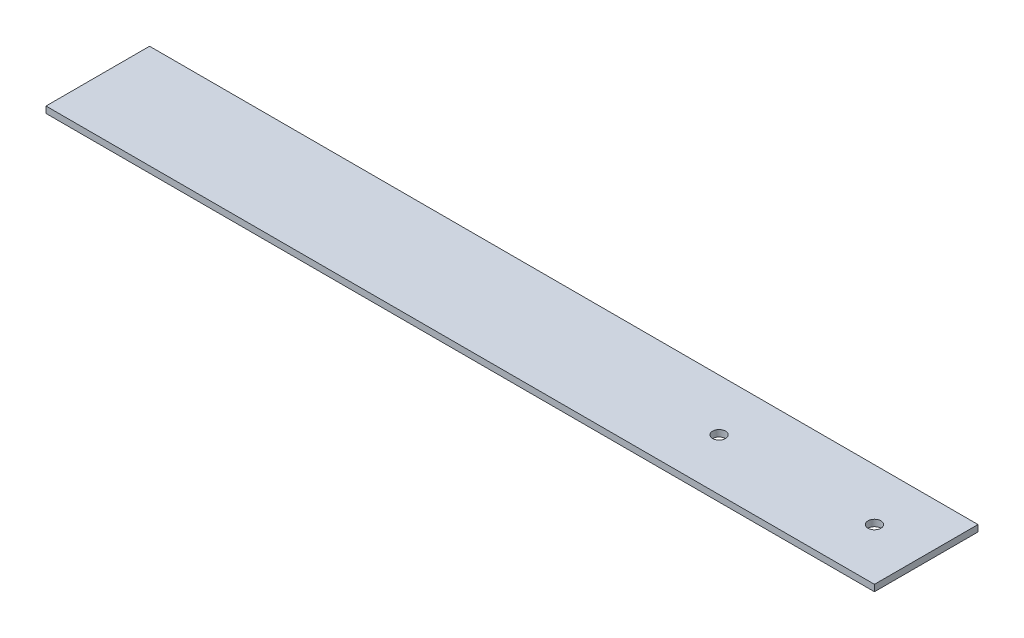
ISO-10303-21;
HEADER;
FILE_DESCRIPTION(('STEP AP214'),'2;1');
FILE_NAME('part.step','',(''),(''),'','','');
FILE_SCHEMA(('AUTOMOTIVE_DESIGN { 1 0 10303 214 1 1 1 1 }'));
ENDSEC;
DATA;
#1=APPLICATION_CONTEXT('core data for automotive mechanical design processes');
#2=APPLICATION_PROTOCOL_DEFINITION('international standard','automotive_design',2000,#1);
#3=PRODUCT_CONTEXT('',#1,'mechanical');
#4=PRODUCT('Part','Part','',(#3));
#5=PRODUCT_RELATED_PRODUCT_CATEGORY('part','',(#4));
#6=PRODUCT_DEFINITION_FORMATION('','',#4);
#7=PRODUCT_DEFINITION_CONTEXT('part definition',#1,'design');
#8=PRODUCT_DEFINITION('design','',#6,#7);
#9=PRODUCT_DEFINITION_SHAPE('','',#8);
#10=(LENGTH_UNIT() NAMED_UNIT(*) SI_UNIT(.MILLI.,.METRE.));
#11=(NAMED_UNIT(*) PLANE_ANGLE_UNIT() SI_UNIT($,.RADIAN.));
#12=(NAMED_UNIT(*) SI_UNIT($,.STERADIAN.) SOLID_ANGLE_UNIT());
#13=UNCERTAINTY_MEASURE_WITH_UNIT(LENGTH_MEASURE(1.E-05),#10,'distance_accuracy_value','');
#14=(GEOMETRIC_REPRESENTATION_CONTEXT(3) GLOBAL_UNCERTAINTY_ASSIGNED_CONTEXT((#13)) GLOBAL_UNIT_ASSIGNED_CONTEXT((#10,
#11,#12)) REPRESENTATION_CONTEXT('',''));
#15=CARTESIAN_POINT('',(0.,0.,0.));
#16=DIRECTION('',(0.,0.,1.));
#17=DIRECTION('',(1.,0.,0.));
#18=AXIS2_PLACEMENT_3D('',#15,#16,#17);
#19=CARTESIAN_POINT('',(0.,3.175,0.));
#20=DIRECTION('',(1.,0.,0.));
#21=DIRECTION('',(0.,0.,-1.));
#22=AXIS2_PLACEMENT_3D('',#19,#20,#21);
#23=PLANE('',#22);
#24=DIRECTION('',(0.,0.,1.));
#25=VECTOR('',#24,1.);
#26=CARTESIAN_POINT('',(0.,0.,0.));
#27=LINE('',#26,#25);
#28=CARTESIAN_POINT('',(0.,0.,-50.8));
#29=VERTEX_POINT('',#28);
#30=CARTESIAN_POINT('',(0.,0.,0.));
#31=VERTEX_POINT('',#30);
#32=EDGE_CURVE('E96',#29,#31,#27,.T.);
#33=ORIENTED_EDGE('',*,*,#32,.T.);
#34=DIRECTION('',(0.,-1.,0.));
#35=VECTOR('',#34,1.);
#36=CARTESIAN_POINT('',(0.,3.175,0.));
#37=LINE('',#36,#35);
#38=CARTESIAN_POINT('',(0.,3.175,0.));
#39=VERTEX_POINT('',#38);
#40=EDGE_CURVE('E11',#39,#31,#37,.T.);
#41=ORIENTED_EDGE('',*,*,#40,.F.);
#42=DIRECTION('',(0.,0.,1.));
#43=VECTOR('',#42,1.);
#44=CARTESIAN_POINT('',(0.,3.175,0.));
#45=LINE('',#44,#43);
#46=CARTESIAN_POINT('',(0.,3.175,-50.8));
#47=VERTEX_POINT('',#46);
#48=EDGE_CURVE('E84',#47,#39,#45,.T.);
#49=ORIENTED_EDGE('',*,*,#48,.F.);
#50=DIRECTION('',(0.,-1.,0.));
#51=VECTOR('',#50,1.);
#52=CARTESIAN_POINT('',(0.,3.175,-50.8));
#53=LINE('',#52,#51);
#54=EDGE_CURVE('E92',#47,#29,#53,.T.);
#55=ORIENTED_EDGE('',*,*,#54,.T.);
#56=EDGE_LOOP('',(#33,#41,#49,#55));
#57=FACE_BOUND('',#56,.T.);
#58=ADVANCED_FACE('F33',(#57),#23,.F.);
#59=CARTESIAN_POINT('',(0.,3.175,0.));
#60=DIRECTION('',(0.,0.,-1.));
#61=DIRECTION('',(-1.,0.,0.));
#62=AXIS2_PLACEMENT_3D('',#59,#60,#61);
#63=PLANE('',#62);
#64=DIRECTION('',(1.,0.,0.));
#65=VECTOR('',#64,1.);
#66=CARTESIAN_POINT('',(0.,0.,0.));
#67=LINE('',#66,#65);
#68=CARTESIAN_POINT('',(406.4,0.,0.));
#69=VERTEX_POINT('',#68);
#70=EDGE_CURVE('E88',#31,#69,#67,.T.);
#71=ORIENTED_EDGE('',*,*,#70,.T.);
#72=DIRECTION('',(0.,-1.,0.));
#73=VECTOR('',#72,1.);
#74=CARTESIAN_POINT('',(406.4,3.175,0.));
#75=LINE('',#74,#73);
#76=CARTESIAN_POINT('',(406.4,3.175,0.));
#77=VERTEX_POINT('',#76);
#78=EDGE_CURVE('E41',#77,#69,#75,.T.);
#79=ORIENTED_EDGE('',*,*,#78,.F.);
#80=DIRECTION('',(1.,0.,0.));
#81=VECTOR('',#80,1.);
#82=CARTESIAN_POINT('',(0.,3.175,0.));
#83=LINE('',#82,#81);
#84=EDGE_CURVE('E79',#39,#77,#83,.T.);
#85=ORIENTED_EDGE('',*,*,#84,.F.);
#86=ORIENTED_EDGE('',*,*,#40,.T.);
#87=EDGE_LOOP('',(#71,#79,#85,#86));
#88=FACE_BOUND('',#87,.T.);
#89=ADVANCED_FACE('F87',(#88),#63,.F.);
#90=CARTESIAN_POINT('',(406.4,3.175,0.));
#91=DIRECTION('',(-1.,0.,0.));
#92=DIRECTION('',(0.,0.,1.));
#93=AXIS2_PLACEMENT_3D('',#90,#91,#92);
#94=PLANE('',#93);
#95=DIRECTION('',(0.,0.,-1.));
#96=VECTOR('',#95,1.);
#97=CARTESIAN_POINT('',(406.4,0.,0.));
#98=LINE('',#97,#96);
#99=CARTESIAN_POINT('',(406.4,0.,-50.8));
#100=VERTEX_POINT('',#99);
#101=EDGE_CURVE('E66',#69,#100,#98,.T.);
#102=ORIENTED_EDGE('',*,*,#101,.T.);
#103=DIRECTION('',(0.,-1.,0.));
#104=VECTOR('',#103,1.);
#105=CARTESIAN_POINT('',(406.4,3.175,-50.8));
#106=LINE('',#105,#104);
#107=CARTESIAN_POINT('',(406.4,3.175,-50.8));
#108=VERTEX_POINT('',#107);
#109=EDGE_CURVE('E89',#108,#100,#106,.T.);
#110=ORIENTED_EDGE('',*,*,#109,.F.);
#111=DIRECTION('',(0.,0.,-1.));
#112=VECTOR('',#111,1.);
#113=CARTESIAN_POINT('',(406.4,3.175,0.));
#114=LINE('',#113,#112);
#115=EDGE_CURVE('E82',#77,#108,#114,.T.);
#116=ORIENTED_EDGE('',*,*,#115,.F.);
#117=ORIENTED_EDGE('',*,*,#78,.T.);
#118=EDGE_LOOP('',(#102,#110,#116,#117));
#119=FACE_BOUND('',#118,.T.);
#120=ADVANCED_FACE('F90',(#119),#94,.F.);
#121=CARTESIAN_POINT('',(0.,3.175,-50.8));
#122=DIRECTION('',(0.,0.,1.));
#123=DIRECTION('',(1.,0.,0.));
#124=AXIS2_PLACEMENT_3D('',#121,#122,#123);
#125=PLANE('',#124);
#126=DIRECTION('',(-1.,0.,0.));
#127=VECTOR('',#126,1.);
#128=CARTESIAN_POINT('',(0.,0.,-50.8));
#129=LINE('',#128,#127);
#130=EDGE_CURVE('E72',#100,#29,#129,.T.);
#131=ORIENTED_EDGE('',*,*,#130,.T.);
#132=ORIENTED_EDGE('',*,*,#54,.F.);
#133=DIRECTION('',(-1.,0.,0.));
#134=VECTOR('',#133,1.);
#135=CARTESIAN_POINT('',(0.,3.175,-50.8));
#136=LINE('',#135,#134);
#137=EDGE_CURVE('E49',#108,#47,#136,.T.);
#138=ORIENTED_EDGE('',*,*,#137,.F.);
#139=ORIENTED_EDGE('',*,*,#109,.T.);
#140=EDGE_LOOP('',(#131,#132,#138,#139));
#141=FACE_BOUND('',#140,.T.);
#142=ADVANCED_FACE('F104',(#141),#125,.F.);
#143=CARTESIAN_POINT('',(0.,3.175,0.));
#144=DIRECTION('',(0.,-1.,0.));
#145=DIRECTION('',(0.,0.,-1.));
#146=AXIS2_PLACEMENT_3D('',#143,#144,#145);
#147=PLANE('',#146);
#148=CARTESIAN_POINT('',(381.,3.175,-25.4));
#149=DIRECTION('',(0.,1.,0.));
#150=DIRECTION('',(0.,0.,1.));
#151=AXIS2_PLACEMENT_3D('',#148,#149,#150);
#152=CIRCLE('',#151,3.17499999999997);
#153=CARTESIAN_POINT('',(381.,3.175,-22.225));
#154=VERTEX_POINT('',#153);
#155=EDGE_CURVE('E116',#154,#154,#152,.T.);
#156=ORIENTED_EDGE('',*,*,#155,.F.);
#157=EDGE_LOOP('',(#156));
#158=FACE_BOUND('',#157,.T.);
#159=CARTESIAN_POINT('',(304.8,3.175,-25.4));
#160=DIRECTION('',(0.,1.,0.));
#161=DIRECTION('',(0.,0.,1.));
#162=AXIS2_PLACEMENT_3D('',#159,#160,#161);
#163=CIRCLE('',#162,3.17499999999997);
#164=CARTESIAN_POINT('',(304.8,3.175,-22.225));
#165=VERTEX_POINT('',#164);
#166=EDGE_CURVE('E110',#165,#165,#163,.T.);
#167=ORIENTED_EDGE('',*,*,#166,.F.);
#168=EDGE_LOOP('',(#167));
#169=FACE_BOUND('',#168,.T.);
#170=ORIENTED_EDGE('',*,*,#48,.T.);
#171=ORIENTED_EDGE('',*,*,#84,.T.);
#172=ORIENTED_EDGE('',*,*,#115,.T.);
#173=ORIENTED_EDGE('',*,*,#137,.T.);
#174=EDGE_LOOP('',(#170,#171,#172,#173));
#175=FACE_BOUND('',#174,.T.);
#176=ADVANCED_FACE('F80',(#158,#169,#175),#147,.F.);
#177=CARTESIAN_POINT('',(0.,0.,0.));
#178=DIRECTION('',(0.,-1.,0.));
#179=DIRECTION('',(0.,0.,-1.));
#180=AXIS2_PLACEMENT_3D('',#177,#178,#179);
#181=PLANE('',#180);
#182=CARTESIAN_POINT('',(381.,0.,-25.4));
#183=DIRECTION('',(0.,1.,0.));
#184=DIRECTION('',(0.,0.,1.));
#185=AXIS2_PLACEMENT_3D('',#182,#183,#184);
#186=CIRCLE('',#185,3.17499999999997);
#187=CARTESIAN_POINT('',(381.,0.,-22.225));
#188=VERTEX_POINT('',#187);
#189=EDGE_CURVE('E99',#188,#188,#186,.T.);
#190=ORIENTED_EDGE('',*,*,#189,.T.);
#191=EDGE_LOOP('',(#190));
#192=FACE_BOUND('',#191,.T.);
#193=CARTESIAN_POINT('',(304.8,0.,-25.4));
#194=DIRECTION('',(0.,1.,0.));
#195=DIRECTION('',(0.,0.,1.));
#196=AXIS2_PLACEMENT_3D('',#193,#194,#195);
#197=CIRCLE('',#196,3.17499999999997);
#198=CARTESIAN_POINT('',(304.8,0.,-22.225));
#199=VERTEX_POINT('',#198);
#200=EDGE_CURVE('E113',#199,#199,#197,.T.);
#201=ORIENTED_EDGE('',*,*,#200,.T.);
#202=EDGE_LOOP('',(#201));
#203=FACE_BOUND('',#202,.T.);
#204=ORIENTED_EDGE('',*,*,#32,.F.);
#205=ORIENTED_EDGE('',*,*,#130,.F.);
#206=ORIENTED_EDGE('',*,*,#101,.F.);
#207=ORIENTED_EDGE('',*,*,#70,.F.);
#208=EDGE_LOOP('',(#204,#205,#206,#207));
#209=FACE_BOUND('',#208,.T.);
#210=ADVANCED_FACE('F107',(#192,#203,#209),#181,.T.);
#211=CARTESIAN_POINT('',(304.8,0.,-25.4));
#212=DIRECTION('',(0.,1.,0.));
#213=DIRECTION('',(0.,0.,1.));
#214=AXIS2_PLACEMENT_3D('',#211,#212,#213);
#215=CYLINDRICAL_SURFACE('',#214,3.17499999999997);
#216=ORIENTED_EDGE('',*,*,#200,.F.);
#217=EDGE_LOOP('',(#216));
#218=FACE_BOUND('',#217,.T.);
#219=ORIENTED_EDGE('',*,*,#166,.T.);
#220=EDGE_LOOP('',(#219));
#221=FACE_BOUND('',#220,.T.);
#222=ADVANCED_FACE('F127',(#218,#221),#215,.F.);
#223=CARTESIAN_POINT('',(381.,0.,-25.4));
#224=DIRECTION('',(0.,1.,0.));
#225=DIRECTION('',(0.,0.,1.));
#226=AXIS2_PLACEMENT_3D('',#223,#224,#225);
#227=CYLINDRICAL_SURFACE('',#226,3.17499999999997);
#228=ORIENTED_EDGE('',*,*,#189,.F.);
#229=EDGE_LOOP('',(#228));
#230=FACE_BOUND('',#229,.T.);
#231=ORIENTED_EDGE('',*,*,#155,.T.);
#232=EDGE_LOOP('',(#231));
#233=FACE_BOUND('',#232,.T.);
#234=ADVANCED_FACE('F124',(#230,#233),#227,.F.);
#235=CLOSED_SHELL('',(#58,#89,#120,#142,#176,#210,#222,#234));
#236=MANIFOLD_SOLID_BREP('B2',#235);
#237=ADVANCED_BREP_SHAPE_REPRESENTATION('',(#18,#236),#14);
#238=SHAPE_DEFINITION_REPRESENTATION(#9,#237);
ENDSEC;
END-ISO-10303-21;
